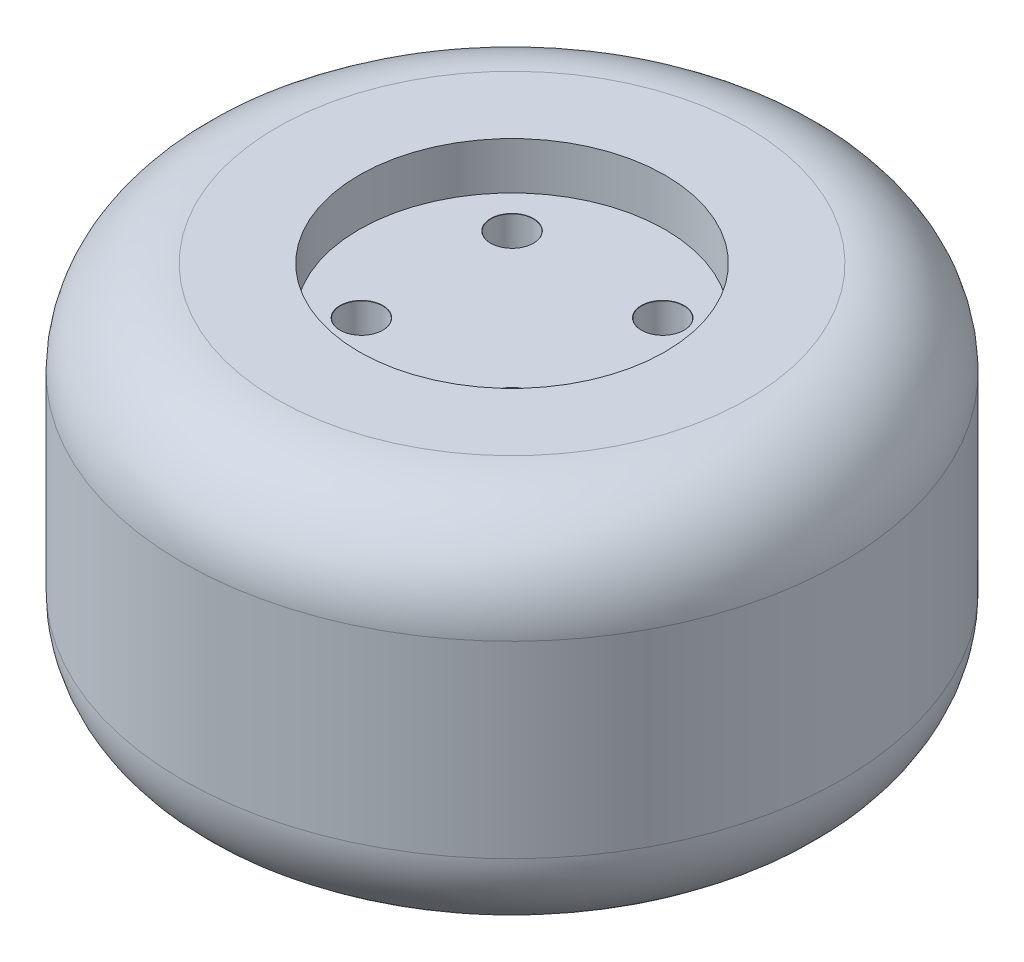
ISO-10303-21;
HEADER;
FILE_DESCRIPTION(('STEP AP214'),'2;1');
FILE_NAME('part.step','',(''),(''),'','','');
FILE_SCHEMA(('AUTOMOTIVE_DESIGN { 1 0 10303 214 1 1 1 1 }'));
ENDSEC;
DATA;
#1=APPLICATION_CONTEXT('core data for automotive mechanical design processes');
#2=APPLICATION_PROTOCOL_DEFINITION('international standard','automotive_design',2000,#1);
#3=PRODUCT_CONTEXT('',#1,'mechanical');
#4=PRODUCT('Part','Part','',(#3));
#5=PRODUCT_RELATED_PRODUCT_CATEGORY('part','',(#4));
#6=PRODUCT_DEFINITION_FORMATION('','',#4);
#7=PRODUCT_DEFINITION_CONTEXT('part definition',#1,'design');
#8=PRODUCT_DEFINITION('design','',#6,#7);
#9=PRODUCT_DEFINITION_SHAPE('','',#8);
#10=(LENGTH_UNIT() NAMED_UNIT(*) SI_UNIT(.MILLI.,.METRE.));
#11=(NAMED_UNIT(*) PLANE_ANGLE_UNIT() SI_UNIT($,.RADIAN.));
#12=(NAMED_UNIT(*) SI_UNIT($,.STERADIAN.) SOLID_ANGLE_UNIT());
#13=UNCERTAINTY_MEASURE_WITH_UNIT(LENGTH_MEASURE(1.E-05),#10,'distance_accuracy_value','');
#14=(GEOMETRIC_REPRESENTATION_CONTEXT(3) GLOBAL_UNCERTAINTY_ASSIGNED_CONTEXT((#13)) GLOBAL_UNIT_ASSIGNED_CONTEXT((#10,
#11,#12)) REPRESENTATION_CONTEXT('',''));
#15=CARTESIAN_POINT('',(0.,0.,0.));
#16=DIRECTION('',(0.,0.,1.));
#17=DIRECTION('',(1.,0.,0.));
#18=AXIS2_PLACEMENT_3D('',#15,#16,#17);
#19=CARTESIAN_POINT('',(0.,40.,0.));
#20=DIRECTION('',(0.,-1.,0.));
#21=DIRECTION('',(0.,0.,-1.));
#22=AXIS2_PLACEMENT_3D('',#19,#20,#21);
#23=CYLINDRICAL_SURFACE('',#22,35.);
#24=CARTESIAN_POINT('',(0.,10.,0.));
#25=DIRECTION('',(0.,1.,0.));
#26=DIRECTION('',(0.,0.,1.));
#27=AXIS2_PLACEMENT_3D('',#24,#25,#26);
#28=CIRCLE('',#27,35.);
#29=CARTESIAN_POINT('',(0.,10.,35.));
#30=VERTEX_POINT('',#29);
#31=EDGE_CURVE('E117',#30,#30,#28,.T.);
#32=ORIENTED_EDGE('',*,*,#31,.T.);
#33=EDGE_LOOP('',(#32));
#34=FACE_BOUND('',#33,.T.);
#35=CARTESIAN_POINT('',(0.,30.,0.));
#36=DIRECTION('',(0.,1.,0.));
#37=DIRECTION('',(0.,0.,1.));
#38=AXIS2_PLACEMENT_3D('',#35,#36,#37);
#39=CIRCLE('',#38,35.);
#40=CARTESIAN_POINT('',(0.,30.,35.));
#41=VERTEX_POINT('',#40);
#42=EDGE_CURVE('E112',#41,#41,#39,.F.);
#43=ORIENTED_EDGE('',*,*,#42,.T.);
#44=EDGE_LOOP('',(#43));
#45=FACE_BOUND('',#44,.T.);
#46=ADVANCED_FACE('F43',(#34,#45),#23,.T.);
#47=CARTESIAN_POINT('',(0.,40.,0.));
#48=DIRECTION('',(0.,1.,0.));
#49=DIRECTION('',(0.,0.,1.));
#50=AXIS2_PLACEMENT_3D('',#47,#48,#49);
#51=PLANE('',#50);
#52=CARTESIAN_POINT('',(0.,40.,0.));
#53=DIRECTION('',(0.,1.,0.));
#54=DIRECTION('',(0.,0.,1.));
#55=AXIS2_PLACEMENT_3D('',#52,#53,#54);
#56=CIRCLE('',#55,25.);
#57=CARTESIAN_POINT('',(0.,40.,25.));
#58=VERTEX_POINT('',#57);
#59=EDGE_CURVE('E11',#58,#58,#56,.T.);
#60=ORIENTED_EDGE('',*,*,#59,.T.);
#61=EDGE_LOOP('',(#60));
#62=FACE_BOUND('',#61,.T.);
#63=CARTESIAN_POINT('',(0.,40.,0.));
#64=DIRECTION('',(0.,1.,0.));
#65=DIRECTION('',(0.,0.,1.));
#66=AXIS2_PLACEMENT_3D('',#63,#64,#65);
#67=CIRCLE('',#66,16.25);
#68=CARTESIAN_POINT('',(0.,40.,16.25));
#69=VERTEX_POINT('',#68);
#70=EDGE_CURVE('E108',#69,#69,#67,.T.);
#71=ORIENTED_EDGE('',*,*,#70,.F.);
#72=EDGE_LOOP('',(#71));
#73=FACE_BOUND('',#72,.T.);
#74=ADVANCED_FACE('F132',(#62,#73),#51,.T.);
#75=CARTESIAN_POINT('',(0.,0.,0.));
#76=DIRECTION('',(0.,1.,0.));
#77=DIRECTION('',(0.,0.,1.));
#78=AXIS2_PLACEMENT_3D('',#75,#76,#77);
#79=PLANE('',#78);
#80=CARTESIAN_POINT('',(0.,0.,0.));
#81=DIRECTION('',(0.,1.,0.));
#82=DIRECTION('',(0.,0.,1.));
#83=AXIS2_PLACEMENT_3D('',#80,#81,#82);
#84=CIRCLE('',#83,25.);
#85=CARTESIAN_POINT('',(0.,0.,25.));
#86=VERTEX_POINT('',#85);
#87=EDGE_CURVE('E51',#86,#86,#84,.F.);
#88=ORIENTED_EDGE('',*,*,#87,.T.);
#89=EDGE_LOOP('',(#88));
#90=FACE_BOUND('',#89,.T.);
#91=ADVANCED_FACE('F122',(#90),#79,.F.);
#92=CARTESIAN_POINT('',(0.,35.,0.));
#93=DIRECTION('',(0.,1.,0.));
#94=DIRECTION('',(0.,0.,1.));
#95=AXIS2_PLACEMENT_3D('',#92,#93,#94);
#96=CYLINDRICAL_SURFACE('',#95,16.25);
#97=CARTESIAN_POINT('',(0.,35.,0.));
#98=DIRECTION('',(0.,1.,0.));
#99=DIRECTION('',(0.,0.,1.));
#100=AXIS2_PLACEMENT_3D('',#97,#98,#99);
#101=CIRCLE('',#100,16.25);
#102=CARTESIAN_POINT('',(0.,35.,16.25));
#103=VERTEX_POINT('',#102);
#104=EDGE_CURVE('E109',#103,#103,#101,.T.);
#105=ORIENTED_EDGE('',*,*,#104,.F.);
#106=EDGE_LOOP('',(#105));
#107=FACE_BOUND('',#106,.T.);
#108=ORIENTED_EDGE('',*,*,#70,.T.);
#109=EDGE_LOOP('',(#108));
#110=FACE_BOUND('',#109,.T.);
#111=ADVANCED_FACE('F145',(#107,#110),#96,.F.);
#112=CARTESIAN_POINT('',(0.,35.,0.));
#113=DIRECTION('',(0.,1.,0.));
#114=DIRECTION('',(0.,0.,1.));
#115=AXIS2_PLACEMENT_3D('',#112,#113,#114);
#116=PLANE('',#115);
#117=CARTESIAN_POINT('',(-8.,35.,-8.));
#118=DIRECTION('',(0.,1.,0.));
#119=DIRECTION('',(0.,0.,1.));
#120=AXIS2_PLACEMENT_3D('',#117,#118,#119);
#121=CIRCLE('',#120,2.275);
#122=CARTESIAN_POINT('',(-8.,35.,-5.725));
#123=VERTEX_POINT('',#122);
#124=EDGE_CURVE('E81',#123,#123,#121,.T.);
#125=ORIENTED_EDGE('',*,*,#124,.F.);
#126=EDGE_LOOP('',(#125));
#127=FACE_BOUND('',#126,.T.);
#128=CARTESIAN_POINT('',(8.,35.,-8.));
#129=DIRECTION('',(0.,1.,0.));
#130=DIRECTION('',(0.,0.,1.));
#131=AXIS2_PLACEMENT_3D('',#128,#129,#130);
#132=CIRCLE('',#131,2.275);
#133=CARTESIAN_POINT('',(8.,35.,-5.725));
#134=VERTEX_POINT('',#133);
#135=EDGE_CURVE('E74',#134,#134,#132,.T.);
#136=ORIENTED_EDGE('',*,*,#135,.F.);
#137=EDGE_LOOP('',(#136));
#138=FACE_BOUND('',#137,.T.);
#139=CARTESIAN_POINT('',(8.,35.,8.));
#140=DIRECTION('',(0.,1.,0.));
#141=DIRECTION('',(0.,0.,1.));
#142=AXIS2_PLACEMENT_3D('',#139,#140,#141);
#143=CIRCLE('',#142,2.275);
#144=CARTESIAN_POINT('',(8.,35.,10.275));
#145=VERTEX_POINT('',#144);
#146=EDGE_CURVE('E90',#145,#145,#143,.T.);
#147=ORIENTED_EDGE('',*,*,#146,.F.);
#148=EDGE_LOOP('',(#147));
#149=FACE_BOUND('',#148,.T.);
#150=CARTESIAN_POINT('',(-8.,35.,8.));
#151=DIRECTION('',(0.,1.,0.));
#152=DIRECTION('',(0.,0.,1.));
#153=AXIS2_PLACEMENT_3D('',#150,#151,#152);
#154=CIRCLE('',#153,2.275);
#155=CARTESIAN_POINT('',(-8.,35.,10.275));
#156=VERTEX_POINT('',#155);
#157=EDGE_CURVE('E99',#156,#156,#154,.T.);
#158=ORIENTED_EDGE('',*,*,#157,.F.);
#159=EDGE_LOOP('',(#158));
#160=FACE_BOUND('',#159,.T.);
#161=ORIENTED_EDGE('',*,*,#104,.T.);
#162=EDGE_LOOP('',(#161));
#163=FACE_BOUND('',#162,.T.);
#164=ADVANCED_FACE('F147',(#127,#138,#149,#160,#163),#116,.T.);
#165=CARTESIAN_POINT('',(-8.,22.,8.));
#166=DIRECTION('',(0.,1.,0.));
#167=DIRECTION('',(0.,0.,1.));
#168=AXIS2_PLACEMENT_3D('',#165,#166,#167);
#169=CONICAL_SURFACE('',#168,2.24999999999999,1.02974425867665);
#170=CARTESIAN_POINT('',(-8.,20.648063607188,8.));
#171=VERTEX_POINT('',#170);
#172=VERTEX_LOOP('',#171);
#173=FACE_BOUND('',#172,.T.);
#174=CARTESIAN_POINT('',(-8.,22.,8.));
#175=DIRECTION('',(0.,1.,0.));
#176=DIRECTION('',(0.,0.,1.));
#177=AXIS2_PLACEMENT_3D('',#174,#175,#176);
#178=CIRCLE('',#177,2.24999999999999);
#179=CARTESIAN_POINT('',(-8.,22.,10.25));
#180=VERTEX_POINT('',#179);
#181=EDGE_CURVE('E105',#180,#180,#178,.T.);
#182=ORIENTED_EDGE('',*,*,#181,.T.);
#183=EDGE_LOOP('',(#182));
#184=FACE_BOUND('',#183,.T.);
#185=ADVANCED_FACE('F153',(#173,#184),#169,.F.);
#186=CARTESIAN_POINT('',(-8.,35.,8.));
#187=DIRECTION('',(0.,1.,0.));
#188=DIRECTION('',(0.,0.,1.));
#189=AXIS2_PLACEMENT_3D('',#186,#187,#188);
#190=CYLINDRICAL_SURFACE('',#189,2.24999999999999);
#191=ORIENTED_EDGE('',*,*,#181,.F.);
#192=EDGE_LOOP('',(#191));
#193=FACE_BOUND('',#192,.T.);
#194=CARTESIAN_POINT('',(-8.,34.975,8.));
#195=DIRECTION('',(0.,1.,0.));
#196=DIRECTION('',(0.,0.,1.));
#197=AXIS2_PLACEMENT_3D('',#194,#195,#196);
#198=CIRCLE('',#197,2.24999999999999);
#199=CARTESIAN_POINT('',(-8.,34.975,10.25));
#200=VERTEX_POINT('',#199);
#201=EDGE_CURVE('E102',#200,#200,#198,.T.);
#202=ORIENTED_EDGE('',*,*,#201,.T.);
#203=EDGE_LOOP('',(#202));
#204=FACE_BOUND('',#203,.T.);
#205=ADVANCED_FACE('F162',(#193,#204),#190,.F.);
#206=CARTESIAN_POINT('',(-8.,35.,8.));
#207=DIRECTION('',(0.,1.,0.));
#208=DIRECTION('',(0.,0.,1.));
#209=AXIS2_PLACEMENT_3D('',#206,#207,#208);
#210=CONICAL_SURFACE('',#209,2.275,0.785398163397414);
#211=ORIENTED_EDGE('',*,*,#201,.F.);
#212=EDGE_LOOP('',(#211));
#213=FACE_BOUND('',#212,.T.);
#214=ORIENTED_EDGE('',*,*,#157,.T.);
#215=EDGE_LOOP('',(#214));
#216=FACE_BOUND('',#215,.T.);
#217=ADVANCED_FACE('F165',(#213,#216),#210,.F.);
#218=CARTESIAN_POINT('',(8.,22.,8.));
#219=DIRECTION('',(0.,1.,0.));
#220=DIRECTION('',(0.,0.,1.));
#221=AXIS2_PLACEMENT_3D('',#218,#219,#220);
#222=CONICAL_SURFACE('',#221,2.24999999999999,1.02974425867665);
#223=CARTESIAN_POINT('',(8.,20.648063607188,8.));
#224=VERTEX_POINT('',#223);
#225=VERTEX_LOOP('',#224);
#226=FACE_BOUND('',#225,.T.);
#227=CARTESIAN_POINT('',(8.,22.,8.));
#228=DIRECTION('',(0.,1.,0.));
#229=DIRECTION('',(0.,0.,1.));
#230=AXIS2_PLACEMENT_3D('',#227,#228,#229);
#231=CIRCLE('',#230,2.24999999999999);
#232=CARTESIAN_POINT('',(8.,22.,10.25));
#233=VERTEX_POINT('',#232);
#234=EDGE_CURVE('E96',#233,#233,#231,.T.);
#235=ORIENTED_EDGE('',*,*,#234,.T.);
#236=EDGE_LOOP('',(#235));
#237=FACE_BOUND('',#236,.T.);
#238=ADVANCED_FACE('F169',(#226,#237),#222,.F.);
#239=CARTESIAN_POINT('',(8.,35.,8.));
#240=DIRECTION('',(0.,1.,0.));
#241=DIRECTION('',(0.,0.,1.));
#242=AXIS2_PLACEMENT_3D('',#239,#240,#241);
#243=CYLINDRICAL_SURFACE('',#242,2.24999999999999);
#244=ORIENTED_EDGE('',*,*,#234,.F.);
#245=EDGE_LOOP('',(#244));
#246=FACE_BOUND('',#245,.T.);
#247=CARTESIAN_POINT('',(8.,34.975,8.));
#248=DIRECTION('',(0.,1.,0.));
#249=DIRECTION('',(0.,0.,1.));
#250=AXIS2_PLACEMENT_3D('',#247,#248,#249);
#251=CIRCLE('',#250,2.24999999999999);
#252=CARTESIAN_POINT('',(8.,34.975,10.25));
#253=VERTEX_POINT('',#252);
#254=EDGE_CURVE('E93',#253,#253,#251,.T.);
#255=ORIENTED_EDGE('',*,*,#254,.T.);
#256=EDGE_LOOP('',(#255));
#257=FACE_BOUND('',#256,.T.);
#258=ADVANCED_FACE('F173',(#246,#257),#243,.F.);
#259=CARTESIAN_POINT('',(8.,35.,8.));
#260=DIRECTION('',(0.,1.,0.));
#261=DIRECTION('',(0.,0.,1.));
#262=AXIS2_PLACEMENT_3D('',#259,#260,#261);
#263=CONICAL_SURFACE('',#262,2.275,0.785398163397414);
#264=ORIENTED_EDGE('',*,*,#254,.F.);
#265=EDGE_LOOP('',(#264));
#266=FACE_BOUND('',#265,.T.);
#267=ORIENTED_EDGE('',*,*,#146,.T.);
#268=EDGE_LOOP('',(#267));
#269=FACE_BOUND('',#268,.T.);
#270=ADVANCED_FACE('F176',(#266,#269),#263,.F.);
#271=CARTESIAN_POINT('',(8.,22.,-8.));
#272=DIRECTION('',(0.,1.,0.));
#273=DIRECTION('',(0.,0.,1.));
#274=AXIS2_PLACEMENT_3D('',#271,#272,#273);
#275=CONICAL_SURFACE('',#274,2.24999999999999,1.02974425867665);
#276=CARTESIAN_POINT('',(8.,20.648063607188,-8.));
#277=VERTEX_POINT('',#276);
#278=VERTEX_LOOP('',#277);
#279=FACE_BOUND('',#278,.T.);
#280=CARTESIAN_POINT('',(8.,22.,-8.));
#281=DIRECTION('',(0.,1.,0.));
#282=DIRECTION('',(0.,0.,1.));
#283=AXIS2_PLACEMENT_3D('',#280,#281,#282);
#284=CIRCLE('',#283,2.24999999999999);
#285=CARTESIAN_POINT('',(8.,22.,-5.75000000000001));
#286=VERTEX_POINT('',#285);
#287=EDGE_CURVE('E87',#286,#286,#284,.T.);
#288=ORIENTED_EDGE('',*,*,#287,.T.);
#289=EDGE_LOOP('',(#288));
#290=FACE_BOUND('',#289,.T.);
#291=ADVANCED_FACE('F180',(#279,#290),#275,.F.);
#292=CARTESIAN_POINT('',(8.,35.,-8.));
#293=DIRECTION('',(0.,1.,0.));
#294=DIRECTION('',(0.,0.,1.));
#295=AXIS2_PLACEMENT_3D('',#292,#293,#294);
#296=CYLINDRICAL_SURFACE('',#295,2.24999999999999);
#297=ORIENTED_EDGE('',*,*,#287,.F.);
#298=EDGE_LOOP('',(#297));
#299=FACE_BOUND('',#298,.T.);
#300=CARTESIAN_POINT('',(8.,34.975,-8.));
#301=DIRECTION('',(0.,1.,0.));
#302=DIRECTION('',(0.,0.,1.));
#303=AXIS2_PLACEMENT_3D('',#300,#301,#302);
#304=CIRCLE('',#303,2.24999999999999);
#305=CARTESIAN_POINT('',(8.,34.975,-5.75000000000001));
#306=VERTEX_POINT('',#305);
#307=EDGE_CURVE('E78',#306,#306,#304,.T.);
#308=ORIENTED_EDGE('',*,*,#307,.T.);
#309=EDGE_LOOP('',(#308));
#310=FACE_BOUND('',#309,.T.);
#311=ADVANCED_FACE('F184',(#299,#310),#296,.F.);
#312=CARTESIAN_POINT('',(8.,35.,-8.));
#313=DIRECTION('',(0.,1.,0.));
#314=DIRECTION('',(0.,0.,1.));
#315=AXIS2_PLACEMENT_3D('',#312,#313,#314);
#316=CONICAL_SURFACE('',#315,2.275,0.785398163397414);
#317=ORIENTED_EDGE('',*,*,#307,.F.);
#318=EDGE_LOOP('',(#317));
#319=FACE_BOUND('',#318,.T.);
#320=ORIENTED_EDGE('',*,*,#135,.T.);
#321=EDGE_LOOP('',(#320));
#322=FACE_BOUND('',#321,.T.);
#323=ADVANCED_FACE('F68',(#319,#322),#316,.F.);
#324=CARTESIAN_POINT('',(-8.,22.,-8.));
#325=DIRECTION('',(0.,1.,0.));
#326=DIRECTION('',(0.,0.,1.));
#327=AXIS2_PLACEMENT_3D('',#324,#325,#326);
#328=CONICAL_SURFACE('',#327,2.24999999999999,1.02974425867665);
#329=CARTESIAN_POINT('',(-8.,20.648063607188,-8.));
#330=VERTEX_POINT('',#329);
#331=VERTEX_LOOP('',#330);
#332=FACE_BOUND('',#331,.T.);
#333=CARTESIAN_POINT('',(-8.,22.,-8.));
#334=DIRECTION('',(0.,1.,0.));
#335=DIRECTION('',(0.,0.,1.));
#336=AXIS2_PLACEMENT_3D('',#333,#334,#335);
#337=CIRCLE('',#336,2.24999999999999);
#338=CARTESIAN_POINT('',(-8.,22.,-5.75000000000001));
#339=VERTEX_POINT('',#338);
#340=EDGE_CURVE('E72',#339,#339,#337,.T.);
#341=ORIENTED_EDGE('',*,*,#340,.T.);
#342=EDGE_LOOP('',(#341));
#343=FACE_BOUND('',#342,.T.);
#344=ADVANCED_FACE('F64',(#332,#343),#328,.F.);
#345=CARTESIAN_POINT('',(-8.,35.,-8.));
#346=DIRECTION('',(0.,1.,0.));
#347=DIRECTION('',(0.,0.,1.));
#348=AXIS2_PLACEMENT_3D('',#345,#346,#347);
#349=CYLINDRICAL_SURFACE('',#348,2.24999999999999);
#350=ORIENTED_EDGE('',*,*,#340,.F.);
#351=EDGE_LOOP('',(#350));
#352=FACE_BOUND('',#351,.T.);
#353=CARTESIAN_POINT('',(-8.,34.975,-8.));
#354=DIRECTION('',(0.,1.,0.));
#355=DIRECTION('',(0.,0.,1.));
#356=AXIS2_PLACEMENT_3D('',#353,#354,#355);
#357=CIRCLE('',#356,2.24999999999999);
#358=CARTESIAN_POINT('',(-8.,34.975,-5.75000000000001));
#359=VERTEX_POINT('',#358);
#360=EDGE_CURVE('E75',#359,#359,#357,.T.);
#361=ORIENTED_EDGE('',*,*,#360,.T.);
#362=EDGE_LOOP('',(#361));
#363=FACE_BOUND('',#362,.T.);
#364=ADVANCED_FACE('F67',(#352,#363),#349,.F.);
#365=CARTESIAN_POINT('',(-8.,35.,-8.));
#366=DIRECTION('',(0.,1.,0.));
#367=DIRECTION('',(0.,0.,1.));
#368=AXIS2_PLACEMENT_3D('',#365,#366,#367);
#369=CONICAL_SURFACE('',#368,2.275,0.785398163397414);
#370=ORIENTED_EDGE('',*,*,#360,.F.);
#371=EDGE_LOOP('',(#370));
#372=FACE_BOUND('',#371,.T.);
#373=ORIENTED_EDGE('',*,*,#124,.T.);
#374=EDGE_LOOP('',(#373));
#375=FACE_BOUND('',#374,.T.);
#376=ADVANCED_FACE('F127',(#372,#375),#369,.F.);
#377=CARTESIAN_POINT('',(0.,10.,0.));
#378=DIRECTION('',(0.,1.,0.));
#379=DIRECTION('',(0.,0.,1.));
#380=AXIS2_PLACEMENT_3D('',#377,#378,#379);
#381=TOROIDAL_SURFACE('',#380,25.,10.);
#382=ORIENTED_EDGE('',*,*,#87,.F.);
#383=EDGE_LOOP('',(#382));
#384=FACE_BOUND('',#383,.T.);
#385=ORIENTED_EDGE('',*,*,#31,.F.);
#386=EDGE_LOOP('',(#385));
#387=FACE_BOUND('',#386,.T.);
#388=ADVANCED_FACE('F124',(#384,#387),#381,.T.);
#389=CARTESIAN_POINT('',(0.,30.,0.));
#390=DIRECTION('',(0.,1.,0.));
#391=DIRECTION('',(0.,0.,1.));
#392=AXIS2_PLACEMENT_3D('',#389,#390,#391);
#393=TOROIDAL_SURFACE('',#392,25.,10.);
#394=ORIENTED_EDGE('',*,*,#42,.F.);
#395=EDGE_LOOP('',(#394));
#396=FACE_BOUND('',#395,.T.);
#397=ORIENTED_EDGE('',*,*,#59,.F.);
#398=EDGE_LOOP('',(#397));
#399=FACE_BOUND('',#398,.T.);
#400=ADVANCED_FACE('F45',(#396,#399),#393,.T.);
#401=CLOSED_SHELL('',(#46,#74,#91,#111,#164,#185,#205,#217,#238,#258,#270,#291,#311,#323,#344,
#364,#376,#388,#400));
#402=MANIFOLD_SOLID_BREP('B2',#401);
#403=ADVANCED_BREP_SHAPE_REPRESENTATION('',(#18,#402),#14);
#404=SHAPE_DEFINITION_REPRESENTATION(#9,#403);
ENDSEC;
END-ISO-10303-21;
